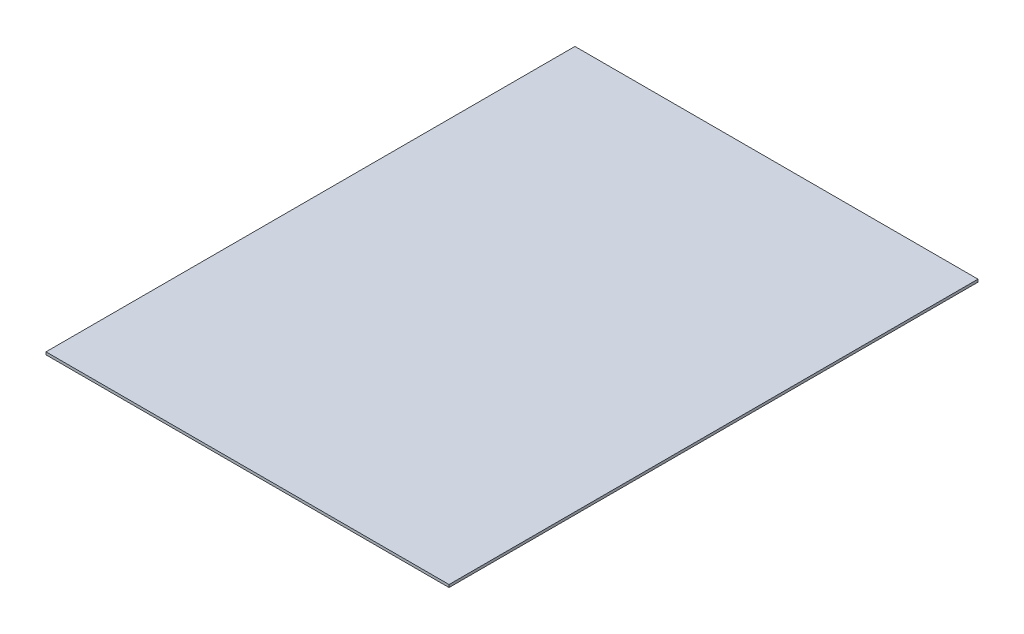
ISO-10303-21;
HEADER;
FILE_DESCRIPTION(('STEP AP214'),'2;1');
FILE_NAME('part.step','',(''),(''),'','','');
FILE_SCHEMA(('AUTOMOTIVE_DESIGN { 1 0 10303 214 1 1 1 1 }'));
ENDSEC;
DATA;
#1=APPLICATION_CONTEXT('core data for automotive mechanical design processes');
#2=APPLICATION_PROTOCOL_DEFINITION('international standard','automotive_design',2000,#1);
#3=PRODUCT_CONTEXT('',#1,'mechanical');
#4=PRODUCT('Part','Part','',(#3));
#5=PRODUCT_RELATED_PRODUCT_CATEGORY('part','',(#4));
#6=PRODUCT_DEFINITION_FORMATION('','',#4);
#7=PRODUCT_DEFINITION_CONTEXT('part definition',#1,'design');
#8=PRODUCT_DEFINITION('design','',#6,#7);
#9=PRODUCT_DEFINITION_SHAPE('','',#8);
#10=(LENGTH_UNIT() NAMED_UNIT(*) SI_UNIT(.MILLI.,.METRE.));
#11=(NAMED_UNIT(*) PLANE_ANGLE_UNIT() SI_UNIT($,.RADIAN.));
#12=(NAMED_UNIT(*) SI_UNIT($,.STERADIAN.) SOLID_ANGLE_UNIT());
#13=UNCERTAINTY_MEASURE_WITH_UNIT(LENGTH_MEASURE(1.E-05),#10,'distance_accuracy_value','');
#14=(GEOMETRIC_REPRESENTATION_CONTEXT(3) GLOBAL_UNCERTAINTY_ASSIGNED_CONTEXT((#13)) GLOBAL_UNIT_ASSIGNED_CONTEXT((#10,
#11,#12)) REPRESENTATION_CONTEXT('',''));
#15=CARTESIAN_POINT('',(0.,0.,0.));
#16=DIRECTION('',(0.,0.,1.));
#17=DIRECTION('',(1.,0.,0.));
#18=AXIS2_PLACEMENT_3D('',#15,#16,#17);
#19=CARTESIAN_POINT('',(762.,10.,-1000.));
#20=DIRECTION('',(-1.,0.,0.));
#21=DIRECTION('',(0.,0.,1.));
#22=AXIS2_PLACEMENT_3D('',#19,#20,#21);
#23=PLANE('',#22);
#24=DIRECTION('',(0.,0.,-1.));
#25=VECTOR('',#24,1.);
#26=CARTESIAN_POINT('',(762.,0.,-1000.));
#27=LINE('',#26,#25);
#28=CARTESIAN_POINT('',(762.,0.,1000.));
#29=VERTEX_POINT('',#28);
#30=CARTESIAN_POINT('',(762.,0.,-1000.));
#31=VERTEX_POINT('',#30);
#32=EDGE_CURVE('E97',#29,#31,#27,.T.);
#33=ORIENTED_EDGE('',*,*,#32,.T.);
#34=DIRECTION('',(0.,-1.,0.));
#35=VECTOR('',#34,1.);
#36=CARTESIAN_POINT('',(762.,10.,-1000.));
#37=LINE('',#36,#35);
#38=CARTESIAN_POINT('',(762.,10.,-1000.));
#39=VERTEX_POINT('',#38);
#40=EDGE_CURVE('E11',#39,#31,#37,.T.);
#41=ORIENTED_EDGE('',*,*,#40,.F.);
#42=DIRECTION('',(0.,0.,-1.));
#43=VECTOR('',#42,1.);
#44=CARTESIAN_POINT('',(762.,10.,-1000.));
#45=LINE('',#44,#43);
#46=CARTESIAN_POINT('',(762.,10.,1000.));
#47=VERTEX_POINT('',#46);
#48=EDGE_CURVE('E85',#47,#39,#45,.T.);
#49=ORIENTED_EDGE('',*,*,#48,.F.);
#50=DIRECTION('',(0.,-1.,0.));
#51=VECTOR('',#50,1.);
#52=CARTESIAN_POINT('',(762.,10.,1000.));
#53=LINE('',#52,#51);
#54=EDGE_CURVE('E93',#47,#29,#53,.T.);
#55=ORIENTED_EDGE('',*,*,#54,.T.);
#56=EDGE_LOOP('',(#33,#41,#49,#55));
#57=FACE_BOUND('',#56,.T.);
#58=ADVANCED_FACE('F34',(#57),#23,.F.);
#59=CARTESIAN_POINT('',(-762.,10.,-1000.));
#60=DIRECTION('',(0.,0.,1.));
#61=DIRECTION('',(1.,0.,0.));
#62=AXIS2_PLACEMENT_3D('',#59,#60,#61);
#63=PLANE('',#62);
#64=DIRECTION('',(-1.,0.,0.));
#65=VECTOR('',#64,1.);
#66=CARTESIAN_POINT('',(-762.,0.,-1000.));
#67=LINE('',#66,#65);
#68=CARTESIAN_POINT('',(-762.,0.,-1000.));
#69=VERTEX_POINT('',#68);
#70=EDGE_CURVE('E89',#31,#69,#67,.T.);
#71=ORIENTED_EDGE('',*,*,#70,.T.);
#72=DIRECTION('',(0.,-1.,0.));
#73=VECTOR('',#72,1.);
#74=CARTESIAN_POINT('',(-762.,10.,-1000.));
#75=LINE('',#74,#73);
#76=CARTESIAN_POINT('',(-762.,10.,-1000.));
#77=VERTEX_POINT('',#76);
#78=EDGE_CURVE('E42',#77,#69,#75,.T.);
#79=ORIENTED_EDGE('',*,*,#78,.F.);
#80=DIRECTION('',(-1.,0.,0.));
#81=VECTOR('',#80,1.);
#82=CARTESIAN_POINT('',(-762.,10.,-1000.));
#83=LINE('',#82,#81);
#84=EDGE_CURVE('E80',#39,#77,#83,.T.);
#85=ORIENTED_EDGE('',*,*,#84,.F.);
#86=ORIENTED_EDGE('',*,*,#40,.T.);
#87=EDGE_LOOP('',(#71,#79,#85,#86));
#88=FACE_BOUND('',#87,.T.);
#89=ADVANCED_FACE('F88',(#88),#63,.F.);
#90=CARTESIAN_POINT('',(-762.,10.,-1000.));
#91=DIRECTION('',(1.,0.,0.));
#92=DIRECTION('',(0.,0.,-1.));
#93=AXIS2_PLACEMENT_3D('',#90,#91,#92);
#94=PLANE('',#93);
#95=DIRECTION('',(0.,0.,1.));
#96=VECTOR('',#95,1.);
#97=CARTESIAN_POINT('',(-762.,0.,-1000.));
#98=LINE('',#97,#96);
#99=CARTESIAN_POINT('',(-762.,0.,1000.));
#100=VERTEX_POINT('',#99);
#101=EDGE_CURVE('E67',#69,#100,#98,.T.);
#102=ORIENTED_EDGE('',*,*,#101,.T.);
#103=DIRECTION('',(0.,-1.,0.));
#104=VECTOR('',#103,1.);
#105=CARTESIAN_POINT('',(-762.,10.,1000.));
#106=LINE('',#105,#104);
#107=CARTESIAN_POINT('',(-762.,10.,1000.));
#108=VERTEX_POINT('',#107);
#109=EDGE_CURVE('E90',#108,#100,#106,.T.);
#110=ORIENTED_EDGE('',*,*,#109,.F.);
#111=DIRECTION('',(0.,0.,1.));
#112=VECTOR('',#111,1.);
#113=CARTESIAN_POINT('',(-762.,10.,-1000.));
#114=LINE('',#113,#112);
#115=EDGE_CURVE('E83',#77,#108,#114,.T.);
#116=ORIENTED_EDGE('',*,*,#115,.F.);
#117=ORIENTED_EDGE('',*,*,#78,.T.);
#118=EDGE_LOOP('',(#102,#110,#116,#117));
#119=FACE_BOUND('',#118,.T.);
#120=ADVANCED_FACE('F91',(#119),#94,.F.);
#121=CARTESIAN_POINT('',(-762.,10.,1000.));
#122=DIRECTION('',(0.,0.,-1.));
#123=DIRECTION('',(-1.,0.,0.));
#124=AXIS2_PLACEMENT_3D('',#121,#122,#123);
#125=PLANE('',#124);
#126=DIRECTION('',(1.,0.,0.));
#127=VECTOR('',#126,1.);
#128=CARTESIAN_POINT('',(-762.,0.,1000.));
#129=LINE('',#128,#127);
#130=EDGE_CURVE('E73',#100,#29,#129,.T.);
#131=ORIENTED_EDGE('',*,*,#130,.T.);
#132=ORIENTED_EDGE('',*,*,#54,.F.);
#133=DIRECTION('',(1.,0.,0.));
#134=VECTOR('',#133,1.);
#135=CARTESIAN_POINT('',(-762.,10.,1000.));
#136=LINE('',#135,#134);
#137=EDGE_CURVE('E50',#108,#47,#136,.T.);
#138=ORIENTED_EDGE('',*,*,#137,.F.);
#139=ORIENTED_EDGE('',*,*,#109,.T.);
#140=EDGE_LOOP('',(#131,#132,#138,#139));
#141=FACE_BOUND('',#140,.T.);
#142=ADVANCED_FACE('F104',(#141),#125,.F.);
#143=CARTESIAN_POINT('',(0.,10.,0.));
#144=DIRECTION('',(0.,1.,0.));
#145=DIRECTION('',(0.,0.,1.));
#146=AXIS2_PLACEMENT_3D('',#143,#144,#145);
#147=PLANE('',#146);
#148=ORIENTED_EDGE('',*,*,#48,.T.);
#149=ORIENTED_EDGE('',*,*,#84,.T.);
#150=ORIENTED_EDGE('',*,*,#115,.T.);
#151=ORIENTED_EDGE('',*,*,#137,.T.);
#152=EDGE_LOOP('',(#148,#149,#150,#151));
#153=FACE_BOUND('',#152,.T.);
#154=ADVANCED_FACE('F81',(#153),#147,.T.);
#155=CARTESIAN_POINT('',(0.,0.,0.));
#156=DIRECTION('',(0.,1.,0.));
#157=DIRECTION('',(0.,0.,1.));
#158=AXIS2_PLACEMENT_3D('',#155,#156,#157);
#159=PLANE('',#158);
#160=ORIENTED_EDGE('',*,*,#32,.F.);
#161=ORIENTED_EDGE('',*,*,#130,.F.);
#162=ORIENTED_EDGE('',*,*,#101,.F.);
#163=ORIENTED_EDGE('',*,*,#70,.F.);
#164=EDGE_LOOP('',(#160,#161,#162,#163));
#165=FACE_BOUND('',#164,.T.);
#166=ADVANCED_FACE('F107',(#165),#159,.F.);
#167=CLOSED_SHELL('',(#58,#89,#120,#142,#154,#166));
#168=MANIFOLD_SOLID_BREP('B2',#167);
#169=ADVANCED_BREP_SHAPE_REPRESENTATION('',(#18,#168),#14);
#170=SHAPE_DEFINITION_REPRESENTATION(#9,#169);
ENDSEC;
END-ISO-10303-21;
